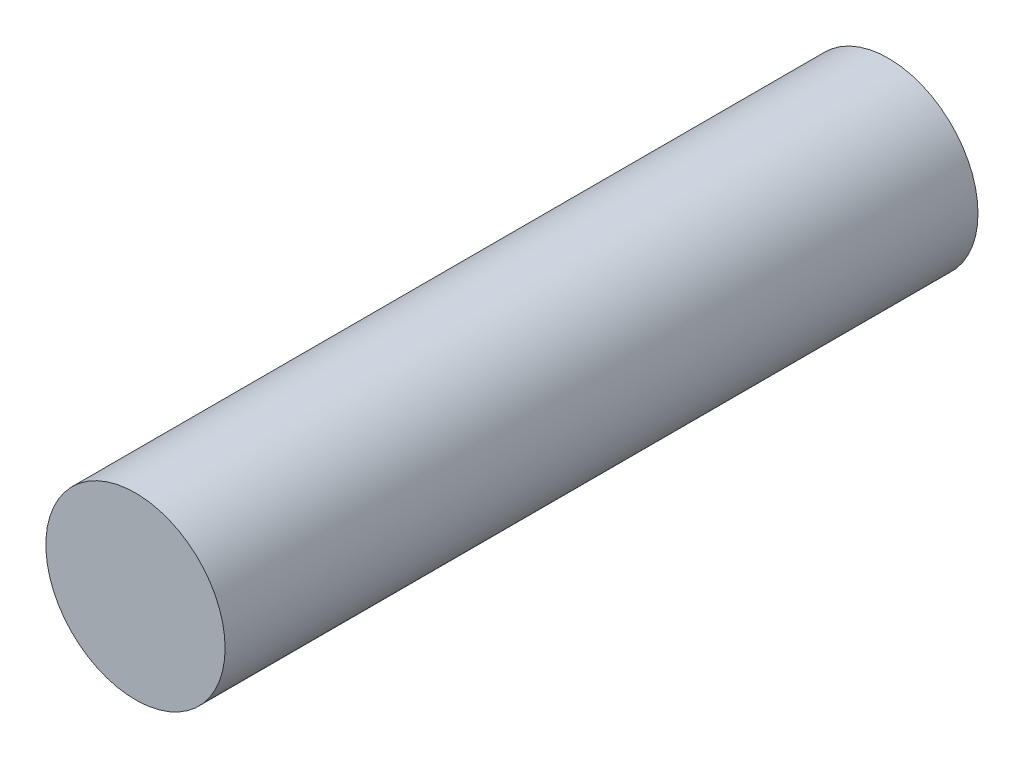
ISO-10303-21;
HEADER;
FILE_DESCRIPTION(('STEP AP214'),'2;1');
FILE_NAME('part.step','',(''),(''),'','','');
FILE_SCHEMA(('AUTOMOTIVE_DESIGN { 1 0 10303 214 1 1 1 1 }'));
ENDSEC;
DATA;
#1=APPLICATION_CONTEXT('core data for automotive mechanical design processes');
#2=APPLICATION_PROTOCOL_DEFINITION('international standard','automotive_design',2000,#1);
#3=PRODUCT_CONTEXT('',#1,'mechanical');
#4=PRODUCT('Part','Part','',(#3));
#5=PRODUCT_RELATED_PRODUCT_CATEGORY('part','',(#4));
#6=PRODUCT_DEFINITION_FORMATION('','',#4);
#7=PRODUCT_DEFINITION_CONTEXT('part definition',#1,'design');
#8=PRODUCT_DEFINITION('design','',#6,#7);
#9=PRODUCT_DEFINITION_SHAPE('','',#8);
#10=(LENGTH_UNIT() NAMED_UNIT(*) SI_UNIT(.MILLI.,.METRE.));
#11=(NAMED_UNIT(*) PLANE_ANGLE_UNIT() SI_UNIT($,.RADIAN.));
#12=(NAMED_UNIT(*) SI_UNIT($,.STERADIAN.) SOLID_ANGLE_UNIT());
#13=UNCERTAINTY_MEASURE_WITH_UNIT(LENGTH_MEASURE(1.E-05),#10,'distance_accuracy_value','');
#14=(GEOMETRIC_REPRESENTATION_CONTEXT(3) GLOBAL_UNCERTAINTY_ASSIGNED_CONTEXT((#13)) GLOBAL_UNIT_ASSIGNED_CONTEXT((#10,
#11,#12)) REPRESENTATION_CONTEXT('',''));
#15=CARTESIAN_POINT('',(0.,0.,0.));
#16=DIRECTION('',(0.,0.,1.));
#17=DIRECTION('',(1.,0.,0.));
#18=AXIS2_PLACEMENT_3D('',#15,#16,#17);
#19=CARTESIAN_POINT('',(0.,0.,31.5));
#20=DIRECTION('',(0.,0.,-1.));
#21=DIRECTION('',(-1.,0.,0.));
#22=AXIS2_PLACEMENT_3D('',#19,#20,#21);
#23=CYLINDRICAL_SURFACE('',#22,3.75);
#24=CARTESIAN_POINT('',(0.,0.,31.5));
#25=DIRECTION('',(0.,0.,1.));
#26=DIRECTION('',(1.,0.,0.));
#27=AXIS2_PLACEMENT_3D('',#24,#25,#26);
#28=CIRCLE('',#27,3.75);
#29=CARTESIAN_POINT('',(3.75,0.,31.5));
#30=VERTEX_POINT('',#29);
#31=EDGE_CURVE('E10',#30,#30,#28,.T.);
#32=ORIENTED_EDGE('',*,*,#31,.F.);
#33=EDGE_LOOP('',(#32));
#34=FACE_BOUND('',#33,.T.);
#35=CARTESIAN_POINT('',(0.,0.,0.));
#36=DIRECTION('',(0.,0.,1.));
#37=DIRECTION('',(1.,0.,0.));
#38=AXIS2_PLACEMENT_3D('',#35,#36,#37);
#39=CIRCLE('',#38,3.75);
#40=CARTESIAN_POINT('',(3.75,0.,0.));
#41=VERTEX_POINT('',#40);
#42=EDGE_CURVE('E34',#41,#41,#39,.T.);
#43=ORIENTED_EDGE('',*,*,#42,.T.);
#44=EDGE_LOOP('',(#43));
#45=FACE_BOUND('',#44,.T.);
#46=ADVANCED_FACE('F31',(#34,#45),#23,.T.);
#47=CARTESIAN_POINT('',(0.,0.,31.5));
#48=DIRECTION('',(0.,0.,1.));
#49=DIRECTION('',(1.,0.,0.));
#50=AXIS2_PLACEMENT_3D('',#47,#48,#49);
#51=PLANE('',#50);
#52=ORIENTED_EDGE('',*,*,#31,.T.);
#53=EDGE_LOOP('',(#52));
#54=FACE_BOUND('',#53,.T.);
#55=ADVANCED_FACE('F46',(#54),#51,.T.);
#56=CARTESIAN_POINT('',(0.,0.,0.));
#57=DIRECTION('',(0.,0.,1.));
#58=DIRECTION('',(1.,0.,0.));
#59=AXIS2_PLACEMENT_3D('',#56,#57,#58);
#60=PLANE('',#59);
#61=ORIENTED_EDGE('',*,*,#42,.F.);
#62=EDGE_LOOP('',(#61));
#63=FACE_BOUND('',#62,.T.);
#64=ADVANCED_FACE('F44',(#63),#60,.F.);
#65=CLOSED_SHELL('',(#46,#55,#64));
#66=MANIFOLD_SOLID_BREP('B2',#65);
#67=ADVANCED_BREP_SHAPE_REPRESENTATION('',(#18,#66),#14);
#68=SHAPE_DEFINITION_REPRESENTATION(#9,#67);
ENDSEC;
END-ISO-10303-21;
